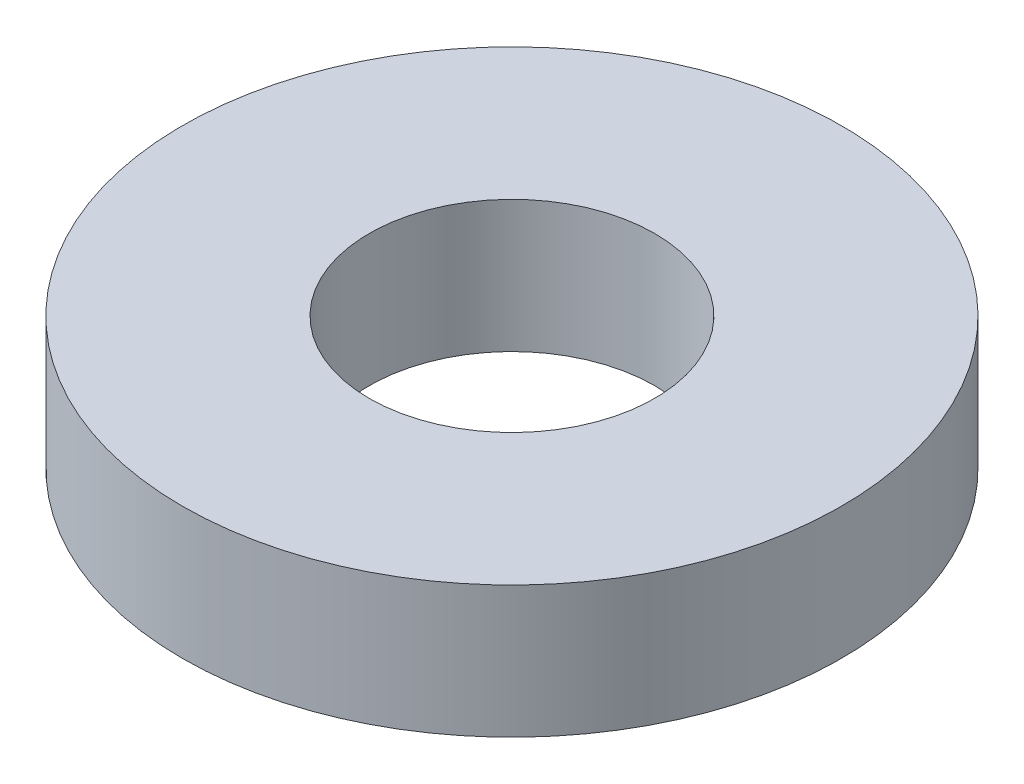
ISO-10303-21;
HEADER;
FILE_DESCRIPTION(('STEP AP214'),'2;1');
FILE_NAME('part.step','',(''),(''),'','','');
FILE_SCHEMA(('AUTOMOTIVE_DESIGN { 1 0 10303 214 1 1 1 1 }'));
ENDSEC;
DATA;
#1=APPLICATION_CONTEXT('core data for automotive mechanical design processes');
#2=APPLICATION_PROTOCOL_DEFINITION('international standard','automotive_design',2000,#1);
#3=PRODUCT_CONTEXT('',#1,'mechanical');
#4=PRODUCT('Part','Part','',(#3));
#5=PRODUCT_RELATED_PRODUCT_CATEGORY('part','',(#4));
#6=PRODUCT_DEFINITION_FORMATION('','',#4);
#7=PRODUCT_DEFINITION_CONTEXT('part definition',#1,'design');
#8=PRODUCT_DEFINITION('design','',#6,#7);
#9=PRODUCT_DEFINITION_SHAPE('','',#8);
#10=(LENGTH_UNIT() NAMED_UNIT(*) SI_UNIT(.MILLI.,.METRE.));
#11=(NAMED_UNIT(*) PLANE_ANGLE_UNIT() SI_UNIT($,.RADIAN.));
#12=(NAMED_UNIT(*) SI_UNIT($,.STERADIAN.) SOLID_ANGLE_UNIT());
#13=UNCERTAINTY_MEASURE_WITH_UNIT(LENGTH_MEASURE(1.E-05),#10,'distance_accuracy_value','');
#14=(GEOMETRIC_REPRESENTATION_CONTEXT(3) GLOBAL_UNCERTAINTY_ASSIGNED_CONTEXT((#13)) GLOBAL_UNIT_ASSIGNED_CONTEXT((#10,
#11,#12)) REPRESENTATION_CONTEXT('',''));
#15=CARTESIAN_POINT('',(0.,0.,0.));
#16=DIRECTION('',(0.,0.,1.));
#17=DIRECTION('',(1.,0.,0.));
#18=AXIS2_PLACEMENT_3D('',#15,#16,#17);
#19=CARTESIAN_POINT('',(0.,1.524,0.));
#20=DIRECTION('',(0.,1.,0.));
#21=DIRECTION('',(0.,0.,1.));
#22=AXIS2_PLACEMENT_3D('',#19,#20,#21);
#23=PLANE('',#22);
#24=CARTESIAN_POINT('',(0.,1.524,0.));
#25=DIRECTION('',(0.,1.,0.));
#26=DIRECTION('',(0.,0.,1.));
#27=AXIS2_PLACEMENT_3D('',#24,#25,#26);
#28=CIRCLE('',#27,3.81);
#29=CARTESIAN_POINT('',(0.,1.524,3.81));
#30=VERTEX_POINT('',#29);
#31=EDGE_CURVE('E10',#30,#30,#28,.T.);
#32=ORIENTED_EDGE('',*,*,#31,.T.);
#33=EDGE_LOOP('',(#32));
#34=FACE_BOUND('',#33,.T.);
#35=CARTESIAN_POINT('',(0.,1.524,0.));
#36=DIRECTION('',(0.,1.,0.));
#37=DIRECTION('',(0.,0.,1.));
#38=AXIS2_PLACEMENT_3D('',#35,#36,#37);
#39=CIRCLE('',#38,1.651);
#40=CARTESIAN_POINT('',(0.,1.524,1.651));
#41=VERTEX_POINT('',#40);
#42=EDGE_CURVE('E54',#41,#41,#39,.T.);
#43=ORIENTED_EDGE('',*,*,#42,.F.);
#44=EDGE_LOOP('',(#43));
#45=FACE_BOUND('',#44,.T.);
#46=ADVANCED_FACE('F43',(#34,#45),#23,.T.);
#47=CARTESIAN_POINT('',(0.,0.,0.));
#48=DIRECTION('',(0.,1.,0.));
#49=DIRECTION('',(0.,0.,1.));
#50=AXIS2_PLACEMENT_3D('',#47,#48,#49);
#51=PLANE('',#50);
#52=CARTESIAN_POINT('',(0.,0.,0.));
#53=DIRECTION('',(0.,1.,0.));
#54=DIRECTION('',(0.,0.,1.));
#55=AXIS2_PLACEMENT_3D('',#52,#53,#54);
#56=CIRCLE('',#55,3.81);
#57=CARTESIAN_POINT('',(0.,0.,3.81));
#58=VERTEX_POINT('',#57);
#59=EDGE_CURVE('E47',#58,#58,#56,.T.);
#60=ORIENTED_EDGE('',*,*,#59,.F.);
#61=EDGE_LOOP('',(#60));
#62=FACE_BOUND('',#61,.T.);
#63=CARTESIAN_POINT('',(0.,0.,0.));
#64=DIRECTION('',(0.,1.,0.));
#65=DIRECTION('',(0.,0.,1.));
#66=AXIS2_PLACEMENT_3D('',#63,#64,#65);
#67=CIRCLE('',#66,1.651);
#68=CARTESIAN_POINT('',(0.,0.,1.651));
#69=VERTEX_POINT('',#68);
#70=EDGE_CURVE('E56',#69,#69,#67,.T.);
#71=ORIENTED_EDGE('',*,*,#70,.T.);
#72=EDGE_LOOP('',(#71));
#73=FACE_BOUND('',#72,.T.);
#74=ADVANCED_FACE('F66',(#62,#73),#51,.F.);
#75=CARTESIAN_POINT('',(0.,1.524,0.));
#76=DIRECTION('',(0.,-1.,0.));
#77=DIRECTION('',(0.,0.,-1.));
#78=AXIS2_PLACEMENT_3D('',#75,#76,#77);
#79=CYLINDRICAL_SURFACE('',#78,3.81);
#80=ORIENTED_EDGE('',*,*,#31,.F.);
#81=EDGE_LOOP('',(#80));
#82=FACE_BOUND('',#81,.T.);
#83=ORIENTED_EDGE('',*,*,#59,.T.);
#84=EDGE_LOOP('',(#83));
#85=FACE_BOUND('',#84,.T.);
#86=ADVANCED_FACE('F45',(#82,#85),#79,.T.);
#87=CARTESIAN_POINT('',(0.,1.524,0.));
#88=DIRECTION('',(0.,-1.,0.));
#89=DIRECTION('',(0.,0.,-1.));
#90=AXIS2_PLACEMENT_3D('',#87,#88,#89);
#91=CYLINDRICAL_SURFACE('',#90,1.651);
#92=ORIENTED_EDGE('',*,*,#42,.T.);
#93=EDGE_LOOP('',(#92));
#94=FACE_BOUND('',#93,.T.);
#95=ORIENTED_EDGE('',*,*,#70,.F.);
#96=EDGE_LOOP('',(#95));
#97=FACE_BOUND('',#96,.T.);
#98=ADVANCED_FACE('F62',(#94,#97),#91,.F.);
#99=CLOSED_SHELL('',(#46,#74,#86,#98));
#100=MANIFOLD_SOLID_BREP('B2',#99);
#101=ADVANCED_BREP_SHAPE_REPRESENTATION('',(#18,#100),#14);
#102=SHAPE_DEFINITION_REPRESENTATION(#9,#101);
ENDSEC;
END-ISO-10303-21;
